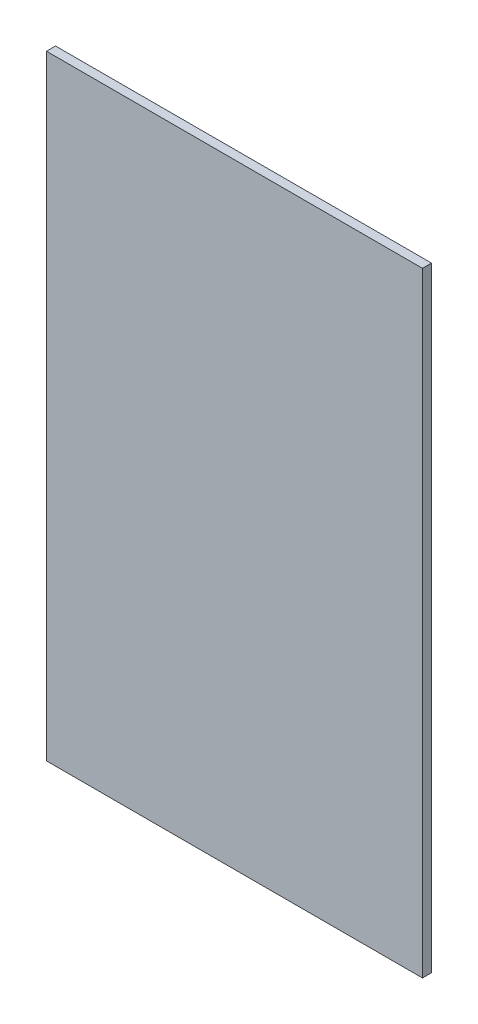
ISO-10303-21;
HEADER;
FILE_DESCRIPTION(('STEP AP214'),'2;1');
FILE_NAME('part.step','',(''),(''),'','','');
FILE_SCHEMA(('AUTOMOTIVE_DESIGN { 1 0 10303 214 1 1 1 1 }'));
ENDSEC;
DATA;
#1=APPLICATION_CONTEXT('core data for automotive mechanical design processes');
#2=APPLICATION_PROTOCOL_DEFINITION('international standard','automotive_design',2000,#1);
#3=PRODUCT_CONTEXT('',#1,'mechanical');
#4=PRODUCT('Part','Part','',(#3));
#5=PRODUCT_RELATED_PRODUCT_CATEGORY('part','',(#4));
#6=PRODUCT_DEFINITION_FORMATION('','',#4);
#7=PRODUCT_DEFINITION_CONTEXT('part definition',#1,'design');
#8=PRODUCT_DEFINITION('design','',#6,#7);
#9=PRODUCT_DEFINITION_SHAPE('','',#8);
#10=(LENGTH_UNIT() NAMED_UNIT(*) SI_UNIT(.MILLI.,.METRE.));
#11=(NAMED_UNIT(*) PLANE_ANGLE_UNIT() SI_UNIT($,.RADIAN.));
#12=(NAMED_UNIT(*) SI_UNIT($,.STERADIAN.) SOLID_ANGLE_UNIT());
#13=UNCERTAINTY_MEASURE_WITH_UNIT(LENGTH_MEASURE(1.E-05),#10,'distance_accuracy_value','');
#14=(GEOMETRIC_REPRESENTATION_CONTEXT(3) GLOBAL_UNCERTAINTY_ASSIGNED_CONTEXT((#13)) GLOBAL_UNIT_ASSIGNED_CONTEXT((#10,
#11,#12)) REPRESENTATION_CONTEXT('',''));
#15=CARTESIAN_POINT('',(0.,0.,0.));
#16=DIRECTION('',(0.,0.,1.));
#17=DIRECTION('',(1.,0.,0.));
#18=AXIS2_PLACEMENT_3D('',#15,#16,#17);
#19=CARTESIAN_POINT('',(104.,-200.,2.5));
#20=DIRECTION('',(-1.,0.,0.));
#21=DIRECTION('',(0.,0.,1.));
#22=AXIS2_PLACEMENT_3D('',#19,#20,#21);
#23=PLANE('',#22);
#24=DIRECTION('',(0.,1.,0.));
#25=VECTOR('',#24,1.);
#26=CARTESIAN_POINT('',(104.,-200.,-2.5));
#27=LINE('',#26,#25);
#28=CARTESIAN_POINT('',(104.,-200.,-2.5));
#29=VERTEX_POINT('',#28);
#30=CARTESIAN_POINT('',(104.,140.,-2.5));
#31=VERTEX_POINT('',#30);
#32=EDGE_CURVE('E82',#29,#31,#27,.T.);
#33=ORIENTED_EDGE('',*,*,#32,.T.);
#34=DIRECTION('',(0.,0.,1.));
#35=VECTOR('',#34,1.);
#36=CARTESIAN_POINT('',(104.,140.,2.5));
#37=LINE('',#36,#35);
#38=CARTESIAN_POINT('',(104.,140.,2.5));
#39=VERTEX_POINT('',#38);
#40=EDGE_CURVE('E46',#31,#39,#37,.T.);
#41=ORIENTED_EDGE('',*,*,#40,.T.);
#42=DIRECTION('',(0.,1.,0.));
#43=VECTOR('',#42,1.);
#44=CARTESIAN_POINT('',(104.,-200.,2.5));
#45=LINE('',#44,#43);
#46=CARTESIAN_POINT('',(104.,-200.,2.5));
#47=VERTEX_POINT('',#46);
#48=EDGE_CURVE('E77',#47,#39,#45,.T.);
#49=ORIENTED_EDGE('',*,*,#48,.F.);
#50=DIRECTION('',(0.,0.,-1.));
#51=VECTOR('',#50,1.);
#52=CARTESIAN_POINT('',(104.,-200.,2.5));
#53=LINE('',#52,#51);
#54=EDGE_CURVE('E71',#47,#29,#53,.T.);
#55=ORIENTED_EDGE('',*,*,#54,.T.);
#56=EDGE_LOOP('',(#33,#41,#49,#55));
#57=FACE_BOUND('',#56,.T.);
#58=ADVANCED_FACE('F33',(#57),#23,.F.);
#59=CARTESIAN_POINT('',(-104.,-200.,2.5));
#60=DIRECTION('',(1.,0.,0.));
#61=DIRECTION('',(0.,0.,-1.));
#62=AXIS2_PLACEMENT_3D('',#59,#60,#61);
#63=PLANE('',#62);
#64=DIRECTION('',(0.,-1.,0.));
#65=VECTOR('',#64,1.);
#66=CARTESIAN_POINT('',(-104.,-200.,2.5));
#67=LINE('',#66,#65);
#68=CARTESIAN_POINT('',(-104.,140.,2.5));
#69=VERTEX_POINT('',#68);
#70=CARTESIAN_POINT('',(-104.,-200.,2.5));
#71=VERTEX_POINT('',#70);
#72=EDGE_CURVE('E91',#69,#71,#67,.T.);
#73=ORIENTED_EDGE('',*,*,#72,.F.);
#74=DIRECTION('',(0.,0.,-1.));
#75=VECTOR('',#74,1.);
#76=CARTESIAN_POINT('',(-104.,140.,2.5));
#77=LINE('',#76,#75);
#78=CARTESIAN_POINT('',(-104.,140.,-2.5));
#79=VERTEX_POINT('',#78);
#80=EDGE_CURVE('E87',#69,#79,#77,.T.);
#81=ORIENTED_EDGE('',*,*,#80,.T.);
#82=DIRECTION('',(0.,-1.,0.));
#83=VECTOR('',#82,1.);
#84=CARTESIAN_POINT('',(-104.,-200.,-2.5));
#85=LINE('',#84,#83);
#86=CARTESIAN_POINT('',(-104.,-200.,-2.5));
#87=VERTEX_POINT('',#86);
#88=EDGE_CURVE('E78',#79,#87,#85,.T.);
#89=ORIENTED_EDGE('',*,*,#88,.T.);
#90=DIRECTION('',(0.,0.,-1.));
#91=VECTOR('',#90,1.);
#92=CARTESIAN_POINT('',(-104.,-200.,2.5));
#93=LINE('',#92,#91);
#94=EDGE_CURVE('E40',#71,#87,#93,.T.);
#95=ORIENTED_EDGE('',*,*,#94,.F.);
#96=EDGE_LOOP('',(#73,#81,#89,#95));
#97=FACE_BOUND('',#96,.T.);
#98=ADVANCED_FACE('F112',(#97),#63,.F.);
#99=CARTESIAN_POINT('',(-104.,-200.,2.5));
#100=DIRECTION('',(0.,1.,0.));
#101=DIRECTION('',(0.,0.,1.));
#102=AXIS2_PLACEMENT_3D('',#99,#100,#101);
#103=PLANE('',#102);
#104=DIRECTION('',(1.,0.,0.));
#105=VECTOR('',#104,1.);
#106=CARTESIAN_POINT('',(-104.,-200.,-2.5));
#107=LINE('',#106,#105);
#108=EDGE_CURVE('E68',#87,#29,#107,.T.);
#109=ORIENTED_EDGE('',*,*,#108,.T.);
#110=ORIENTED_EDGE('',*,*,#54,.F.);
#111=DIRECTION('',(1.,0.,0.));
#112=VECTOR('',#111,1.);
#113=CARTESIAN_POINT('',(-104.,-200.,2.5));
#114=LINE('',#113,#112);
#115=EDGE_CURVE('E55',#71,#47,#114,.T.);
#116=ORIENTED_EDGE('',*,*,#115,.F.);
#117=ORIENTED_EDGE('',*,*,#94,.T.);
#118=EDGE_LOOP('',(#109,#110,#116,#117));
#119=FACE_BOUND('',#118,.T.);
#120=ADVANCED_FACE('F70',(#119),#103,.F.);
#121=CARTESIAN_POINT('',(0.,0.,2.5));
#122=DIRECTION('',(0.,0.,-1.));
#123=DIRECTION('',(-1.,0.,0.));
#124=AXIS2_PLACEMENT_3D('',#121,#122,#123);
#125=PLANE('',#124);
#126=ORIENTED_EDGE('',*,*,#48,.T.);
#127=DIRECTION('',(1.,0.,0.));
#128=VECTOR('',#127,1.);
#129=CARTESIAN_POINT('',(-155.213981646796,140.,2.5));
#130=LINE('',#129,#128);
#131=EDGE_CURVE('E96',#69,#39,#130,.T.);
#132=ORIENTED_EDGE('',*,*,#131,.F.);
#133=ORIENTED_EDGE('',*,*,#72,.T.);
#134=ORIENTED_EDGE('',*,*,#115,.T.);
#135=EDGE_LOOP('',(#126,#132,#133,#134));
#136=FACE_BOUND('',#135,.T.);
#137=ADVANCED_FACE('F104',(#136),#125,.F.);
#138=CARTESIAN_POINT('',(0.,0.,-2.5));
#139=DIRECTION('',(0.,0.,-1.));
#140=DIRECTION('',(-1.,0.,0.));
#141=AXIS2_PLACEMENT_3D('',#138,#139,#140);
#142=PLANE('',#141);
#143=DIRECTION('',(-1.,0.,0.));
#144=VECTOR('',#143,1.);
#145=CARTESIAN_POINT('',(0.,140.,-2.5));
#146=LINE('',#145,#144);
#147=EDGE_CURVE('E11',#31,#79,#146,.T.);
#148=ORIENTED_EDGE('',*,*,#147,.F.);
#149=ORIENTED_EDGE('',*,*,#32,.F.);
#150=ORIENTED_EDGE('',*,*,#108,.F.);
#151=ORIENTED_EDGE('',*,*,#88,.F.);
#152=EDGE_LOOP('',(#148,#149,#150,#151));
#153=FACE_BOUND('',#152,.T.);
#154=ADVANCED_FACE('F84',(#153),#142,.T.);
#155=CARTESIAN_POINT('',(-155.213981646796,140.,-2.5));
#156=DIRECTION('',(0.,-1.,0.));
#157=DIRECTION('',(0.,0.,-1.));
#158=AXIS2_PLACEMENT_3D('',#155,#156,#157);
#159=PLANE('',#158);
#160=ORIENTED_EDGE('',*,*,#147,.T.);
#161=ORIENTED_EDGE('',*,*,#80,.F.);
#162=ORIENTED_EDGE('',*,*,#131,.T.);
#163=ORIENTED_EDGE('',*,*,#40,.F.);
#164=EDGE_LOOP('',(#160,#161,#162,#163));
#165=FACE_BOUND('',#164,.T.);
#166=ADVANCED_FACE('F100',(#165),#159,.F.);
#167=CLOSED_SHELL('',(#58,#98,#120,#137,#154,#166));
#168=MANIFOLD_SOLID_BREP('B2',#167);
#169=ADVANCED_BREP_SHAPE_REPRESENTATION('',(#18,#168),#14);
#170=SHAPE_DEFINITION_REPRESENTATION(#9,#169);
ENDSEC;
END-ISO-10303-21;
